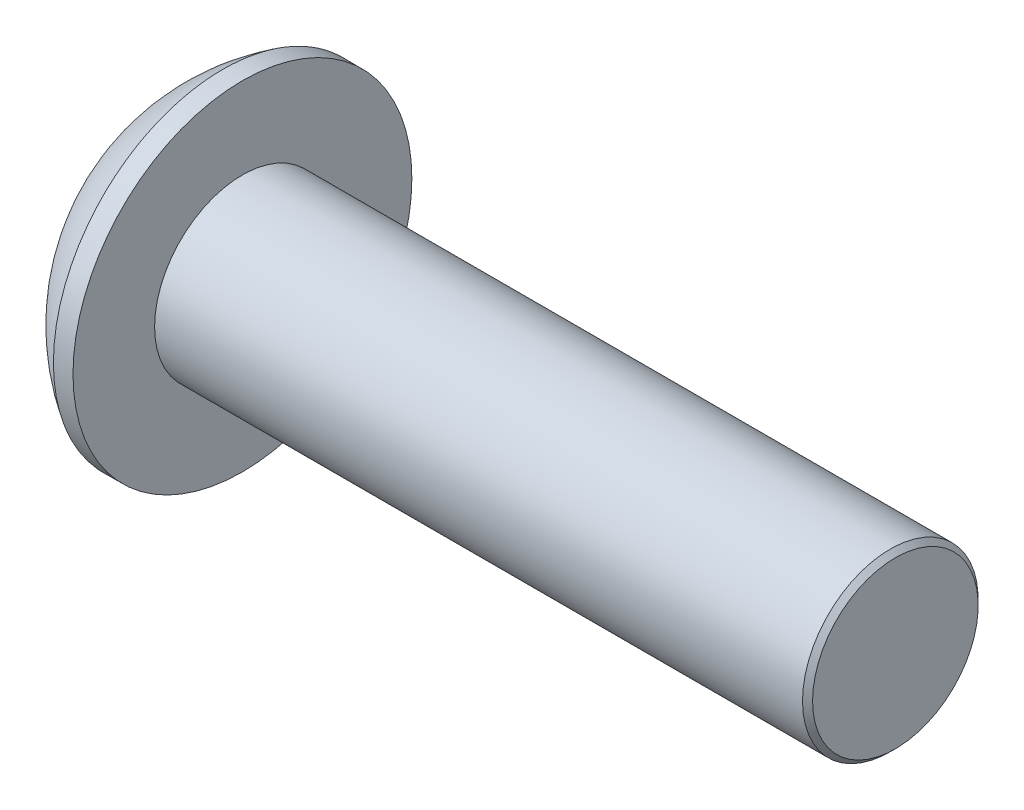
ISO-10303-21;
HEADER;
FILE_DESCRIPTION(('STEP AP214'),'2;1');
FILE_NAME('part.step','',(''),(''),'','','');
FILE_SCHEMA(('AUTOMOTIVE_DESIGN { 1 0 10303 214 1 1 1 1 }'));
ENDSEC;
DATA;
#1=APPLICATION_CONTEXT('core data for automotive mechanical design processes');
#2=APPLICATION_PROTOCOL_DEFINITION('international standard','automotive_design',2000,#1);
#3=PRODUCT_CONTEXT('',#1,'mechanical');
#4=PRODUCT('Part','Part','',(#3));
#5=PRODUCT_RELATED_PRODUCT_CATEGORY('part','',(#4));
#6=PRODUCT_DEFINITION_FORMATION('','',#4);
#7=PRODUCT_DEFINITION_CONTEXT('part definition',#1,'design');
#8=PRODUCT_DEFINITION('design','',#6,#7);
#9=PRODUCT_DEFINITION_SHAPE('','',#8);
#10=(LENGTH_UNIT() NAMED_UNIT(*) SI_UNIT(.MILLI.,.METRE.));
#11=(NAMED_UNIT(*) PLANE_ANGLE_UNIT() SI_UNIT($,.RADIAN.));
#12=(NAMED_UNIT(*) SI_UNIT($,.STERADIAN.) SOLID_ANGLE_UNIT());
#13=UNCERTAINTY_MEASURE_WITH_UNIT(LENGTH_MEASURE(1.E-05),#10,'distance_accuracy_value','');
#14=(GEOMETRIC_REPRESENTATION_CONTEXT(3) GLOBAL_UNCERTAINTY_ASSIGNED_CONTEXT((#13)) GLOBAL_UNIT_ASSIGNED_CONTEXT((#10,
#11,#12)) REPRESENTATION_CONTEXT('',''));
#15=CARTESIAN_POINT('',(0.,0.,0.));
#16=DIRECTION('',(0.,0.,1.));
#17=DIRECTION('',(1.,0.,0.));
#18=AXIS2_PLACEMENT_3D('',#15,#16,#17);
#19=CARTESIAN_POINT('',(1.32080000000034,0.,0.));
#20=DIRECTION('',(-1.,0.,0.));
#21=DIRECTION('',(0.,0.,1.));
#22=AXIS2_PLACEMENT_3D('',#19,#20,#21);
#23=CONICAL_SURFACE('',#22,1.1937999999998,1.04719755119608);
#24=CARTESIAN_POINT('',(2.01004075135902,0.,4.44089209850063E-13));
#25=VERTEX_POINT('',#24);
#26=VERTEX_LOOP('',#25);
#27=FACE_BOUND('',#26,.T.);
#28=CARTESIAN_POINT('',(1.32080000000009,0.,0.));
#29=DIRECTION('',(-1.,0.,0.));
#30=DIRECTION('',(0.,0.,1.));
#31=AXIS2_PLACEMENT_3D('',#28,#29,#30);
#32=CIRCLE('',#31,1.19380000000024);
#33=CARTESIAN_POINT('',(1.32080000000004,-1.03386112703797,0.59690000000006));
#34=VERTEX_POINT('',#33);
#35=CARTESIAN_POINT('',(1.32080000000004,0.,1.19380000000012));
#36=VERTEX_POINT('',#35);
#37=EDGE_CURVE('E19',#34,#36,#32,.T.);
#38=ORIENTED_EDGE('',*,*,#37,.T.);
#39=CARTESIAN_POINT('',(1.32080000000009,0.,0.));
#40=DIRECTION('',(-1.,0.,0.));
#41=DIRECTION('',(0.,0.,1.));
#42=AXIS2_PLACEMENT_3D('',#39,#40,#41);
#43=CIRCLE('',#42,1.19380000000024);
#44=CARTESIAN_POINT('',(1.32080000000004,1.03386112703797,0.596900000000061));
#45=VERTEX_POINT('',#44);
#46=EDGE_CURVE('E147',#36,#45,#43,.T.);
#47=ORIENTED_EDGE('',*,*,#46,.T.);
#48=CARTESIAN_POINT('',(1.32080000000009,0.,0.));
#49=DIRECTION('',(-1.,0.,0.));
#50=DIRECTION('',(0.,0.,1.));
#51=AXIS2_PLACEMENT_3D('',#48,#49,#50);
#52=CIRCLE('',#51,1.19380000000024);
#53=CARTESIAN_POINT('',(1.32080000000004,1.03386112703797,-0.596900000000061));
#54=VERTEX_POINT('',#53);
#55=EDGE_CURVE('E317',#45,#54,#52,.T.);
#56=ORIENTED_EDGE('',*,*,#55,.T.);
#57=CARTESIAN_POINT('',(1.32080000000009,0.,0.));
#58=DIRECTION('',(-1.,0.,0.));
#59=DIRECTION('',(0.,0.,1.));
#60=AXIS2_PLACEMENT_3D('',#57,#58,#59);
#61=CIRCLE('',#60,1.19380000000024);
#62=CARTESIAN_POINT('',(1.32080000000004,1.49457637585666E-12,-1.19380000000012));
#63=VERTEX_POINT('',#62);
#64=EDGE_CURVE('E318',#54,#63,#61,.T.);
#65=ORIENTED_EDGE('',*,*,#64,.T.);
#66=CARTESIAN_POINT('',(1.32080000000009,0.,0.));
#67=DIRECTION('',(-1.,0.,0.));
#68=DIRECTION('',(0.,0.,1.));
#69=AXIS2_PLACEMENT_3D('',#66,#67,#68);
#70=CIRCLE('',#69,1.19380000000024);
#71=CARTESIAN_POINT('',(1.32080000000004,-1.03386112703797,-0.59690000000006));
#72=VERTEX_POINT('',#71);
#73=EDGE_CURVE('E92',#63,#72,#70,.T.);
#74=ORIENTED_EDGE('',*,*,#73,.T.);
#75=CARTESIAN_POINT('',(1.32080000000009,0.,0.));
#76=DIRECTION('',(-1.,0.,0.));
#77=DIRECTION('',(0.,0.,1.));
#78=AXIS2_PLACEMENT_3D('',#75,#76,#77);
#79=CIRCLE('',#78,1.19380000000024);
#80=EDGE_CURVE('E88',#72,#34,#79,.T.);
#81=ORIENTED_EDGE('',*,*,#80,.T.);
#82=EDGE_LOOP('',(#38,#47,#56,#65,#74,#81));
#83=FACE_BOUND('',#82,.T.);
#84=ADVANCED_FACE('F16',(#27,#83),#23,.F.);
#85=CARTESIAN_POINT('',(1.3208,-2.06772225407572,-1.1938));
#86=DIRECTION('',(1.,0.,0.));
#87=DIRECTION('',(0.,0.,-1.));
#88=AXIS2_PLACEMENT_3D('',#85,#86,#87);
#89=PLANE('',#88);
#90=DIRECTION('',(0.,0.5,0.866025403784439));
#91=VECTOR('',#90,1.);
#92=CARTESIAN_POINT('',(1.3208,-1.37848150271715,0.));
#93=LINE('',#92,#91);
#94=CARTESIAN_POINT('',(1.3208,-0.689240751358574,1.1938));
#95=VERTEX_POINT('',#94);
#96=EDGE_CURVE('E100',#95,#34,#93,.F.);
#97=ORIENTED_EDGE('',*,*,#96,.F.);
#98=DIRECTION('',(0.,1.,0.));
#99=VECTOR('',#98,1.);
#100=CARTESIAN_POINT('',(1.3208,-0.689240751358574,1.1938));
#101=LINE('',#100,#99);
#102=EDGE_CURVE('E102',#36,#95,#101,.F.);
#103=ORIENTED_EDGE('',*,*,#102,.F.);
#104=ORIENTED_EDGE('',*,*,#37,.F.);
#105=EDGE_LOOP('',(#97,#103,#104));
#106=FACE_BOUND('',#105,.T.);
#107=ADVANCED_FACE('F98',(#106),#89,.F.);
#108=CARTESIAN_POINT('',(1.3208,-2.06772225407572,-1.1938));
#109=DIRECTION('',(1.,0.,0.));
#110=DIRECTION('',(0.,0.,-1.));
#111=AXIS2_PLACEMENT_3D('',#108,#109,#110);
#112=PLANE('',#111);
#113=DIRECTION('',(0.,-0.5,0.866025403784439));
#114=VECTOR('',#113,1.);
#115=CARTESIAN_POINT('',(1.3208,-0.689240751358574,-1.1938));
#116=LINE('',#115,#114);
#117=CARTESIAN_POINT('',(1.3208,-1.37848150271715,0.));
#118=VERTEX_POINT('',#117);
#119=EDGE_CURVE('E108',#118,#72,#116,.F.);
#120=ORIENTED_EDGE('',*,*,#119,.F.);
#121=DIRECTION('',(0.,0.5,0.866025403784439));
#122=VECTOR('',#121,1.);
#123=CARTESIAN_POINT('',(1.3208,-1.37848150271715,0.));
#124=LINE('',#123,#122);
#125=EDGE_CURVE('E105',#34,#118,#124,.F.);
#126=ORIENTED_EDGE('',*,*,#125,.F.);
#127=ORIENTED_EDGE('',*,*,#80,.F.);
#128=EDGE_LOOP('',(#120,#126,#127));
#129=FACE_BOUND('',#128,.T.);
#130=ADVANCED_FACE('F106',(#129),#112,.F.);
#131=CARTESIAN_POINT('',(1.3208,-2.06772225407572,-1.1938));
#132=DIRECTION('',(1.,0.,0.));
#133=DIRECTION('',(0.,0.,-1.));
#134=AXIS2_PLACEMENT_3D('',#131,#132,#133);
#135=PLANE('',#134);
#136=DIRECTION('',(0.,1.,0.));
#137=VECTOR('',#136,1.);
#138=CARTESIAN_POINT('',(1.3208,0.689240751358577,-1.1938));
#139=LINE('',#138,#137);
#140=CARTESIAN_POINT('',(1.3208,-0.689240751358574,-1.1938));
#141=VERTEX_POINT('',#140);
#142=EDGE_CURVE('E287',#141,#63,#139,.T.);
#143=ORIENTED_EDGE('',*,*,#142,.F.);
#144=DIRECTION('',(0.,-0.5,0.866025403784439));
#145=VECTOR('',#144,1.);
#146=CARTESIAN_POINT('',(1.3208,-0.689240751358574,-1.1938));
#147=LINE('',#146,#145);
#148=EDGE_CURVE('E299',#72,#141,#147,.F.);
#149=ORIENTED_EDGE('',*,*,#148,.F.);
#150=ORIENTED_EDGE('',*,*,#73,.F.);
#151=EDGE_LOOP('',(#143,#149,#150));
#152=FACE_BOUND('',#151,.T.);
#153=ADVANCED_FACE('F190',(#152),#135,.F.);
#154=CARTESIAN_POINT('',(1.3208,-2.06772225407572,-1.1938));
#155=DIRECTION('',(1.,0.,0.));
#156=DIRECTION('',(0.,0.,-1.));
#157=AXIS2_PLACEMENT_3D('',#154,#155,#156);
#158=PLANE('',#157);
#159=DIRECTION('',(0.,-0.5,-0.866025403784439));
#160=VECTOR('',#159,1.);
#161=CARTESIAN_POINT('',(1.3208,1.37848150271715,0.));
#162=LINE('',#161,#160);
#163=CARTESIAN_POINT('',(1.3208,0.689240751358577,-1.1938));
#164=VERTEX_POINT('',#163);
#165=EDGE_CURVE('E273',#164,#54,#162,.F.);
#166=ORIENTED_EDGE('',*,*,#165,.F.);
#167=DIRECTION('',(0.,1.,0.));
#168=VECTOR('',#167,1.);
#169=CARTESIAN_POINT('',(1.3208,0.689240751358577,-1.1938));
#170=LINE('',#169,#168);
#171=EDGE_CURVE('E284',#63,#164,#170,.T.);
#172=ORIENTED_EDGE('',*,*,#171,.F.);
#173=ORIENTED_EDGE('',*,*,#64,.F.);
#174=EDGE_LOOP('',(#166,#172,#173));
#175=FACE_BOUND('',#174,.T.);
#176=ADVANCED_FACE('F186',(#175),#158,.F.);
#177=CARTESIAN_POINT('',(1.3208,-2.06772225407572,-1.1938));
#178=DIRECTION('',(1.,0.,0.));
#179=DIRECTION('',(0.,0.,-1.));
#180=AXIS2_PLACEMENT_3D('',#177,#178,#179);
#181=PLANE('',#180);
#182=DIRECTION('',(0.,0.5,-0.866025403784439));
#183=VECTOR('',#182,1.);
#184=CARTESIAN_POINT('',(1.3208,0.689240751358576,1.1938));
#185=LINE('',#184,#183);
#186=CARTESIAN_POINT('',(1.3208,1.37848150271715,0.));
#187=VERTEX_POINT('',#186);
#188=EDGE_CURVE('E252',#187,#45,#185,.F.);
#189=ORIENTED_EDGE('',*,*,#188,.F.);
#190=DIRECTION('',(0.,-0.5,-0.866025403784439));
#191=VECTOR('',#190,1.);
#192=CARTESIAN_POINT('',(1.3208,1.37848150271715,0.));
#193=LINE('',#192,#191);
#194=EDGE_CURVE('E271',#54,#187,#193,.F.);
#195=ORIENTED_EDGE('',*,*,#194,.F.);
#196=ORIENTED_EDGE('',*,*,#55,.F.);
#197=EDGE_LOOP('',(#189,#195,#196));
#198=FACE_BOUND('',#197,.T.);
#199=ADVANCED_FACE('F182',(#198),#181,.F.);
#200=CARTESIAN_POINT('',(1.3208,-2.06772225407572,-1.1938));
#201=DIRECTION('',(1.,0.,0.));
#202=DIRECTION('',(0.,0.,-1.));
#203=AXIS2_PLACEMENT_3D('',#200,#201,#202);
#204=PLANE('',#203);
#205=DIRECTION('',(0.,1.,0.));
#206=VECTOR('',#205,1.);
#207=CARTESIAN_POINT('',(1.3208,-0.689240751358574,1.1938));
#208=LINE('',#207,#206);
#209=CARTESIAN_POINT('',(1.3208,0.689240751358576,1.1938));
#210=VERTEX_POINT('',#209);
#211=EDGE_CURVE('E117',#210,#36,#208,.F.);
#212=ORIENTED_EDGE('',*,*,#211,.F.);
#213=DIRECTION('',(0.,0.5,-0.866025403784439));
#214=VECTOR('',#213,1.);
#215=CARTESIAN_POINT('',(1.3208,0.689240751358576,1.1938));
#216=LINE('',#215,#214);
#217=EDGE_CURVE('E255',#45,#210,#216,.F.);
#218=ORIENTED_EDGE('',*,*,#217,.F.);
#219=ORIENTED_EDGE('',*,*,#46,.F.);
#220=EDGE_LOOP('',(#212,#218,#219));
#221=FACE_BOUND('',#220,.T.);
#222=ADVANCED_FACE('F178',(#221),#204,.F.);
#223=CARTESIAN_POINT('',(1.3208,-0.689240751358574,1.1938));
#224=DIRECTION('',(0.,0.,-1.));
#225=DIRECTION('',(0.,1.,0.));
#226=AXIS2_PLACEMENT_3D('',#223,#224,#225);
#227=PLANE('',#226);
#228=DIRECTION('',(0.,1.,0.));
#229=VECTOR('',#228,1.);
#230=CARTESIAN_POINT('',(0.,0.,1.1938));
#231=LINE('',#230,#229);
#232=CARTESIAN_POINT('',(0.,0.689240751358577,1.1938));
#233=VERTEX_POINT('',#232);
#234=CARTESIAN_POINT('',(0.,-0.689240751358574,1.1938));
#235=VERTEX_POINT('',#234);
#236=EDGE_CURVE('E249',#233,#235,#231,.F.);
#237=ORIENTED_EDGE('',*,*,#236,.F.);
#238=DIRECTION('',(1.,0.,0.));
#239=VECTOR('',#238,1.);
#240=CARTESIAN_POINT('',(1.3208,0.689240751358576,1.1938));
#241=LINE('',#240,#239);
#242=EDGE_CURVE('E261',#210,#233,#241,.F.);
#243=ORIENTED_EDGE('',*,*,#242,.F.);
#244=ORIENTED_EDGE('',*,*,#211,.T.);
#245=ORIENTED_EDGE('',*,*,#102,.T.);
#246=DIRECTION('',(1.,0.,0.));
#247=VECTOR('',#246,1.);
#248=CARTESIAN_POINT('',(1.3208,-0.689240751358574,1.1938));
#249=LINE('',#248,#247);
#250=EDGE_CURVE('E111',#235,#95,#249,.T.);
#251=ORIENTED_EDGE('',*,*,#250,.F.);
#252=EDGE_LOOP('',(#237,#243,#244,#245,#251));
#253=FACE_BOUND('',#252,.T.);
#254=ADVANCED_FACE('F175',(#253),#227,.T.);
#255=CARTESIAN_POINT('',(1.3208,-1.37848150271715,0.));
#256=DIRECTION('',(0.,0.866025403784439,-0.5));
#257=DIRECTION('',(0.,0.5,0.866025403784439));
#258=AXIS2_PLACEMENT_3D('',#255,#256,#257);
#259=PLANE('',#258);
#260=DIRECTION('',(0.,-0.5,-0.866025403784439));
#261=VECTOR('',#260,1.);
#262=CARTESIAN_POINT('',(0.,-0.689240751358574,1.1938));
#263=LINE('',#262,#261);
#264=CARTESIAN_POINT('',(0.,-1.37848150271715,0.));
#265=VERTEX_POINT('',#264);
#266=EDGE_CURVE('E246',#235,#265,#263,.T.);
#267=ORIENTED_EDGE('',*,*,#266,.F.);
#268=ORIENTED_EDGE('',*,*,#250,.T.);
#269=ORIENTED_EDGE('',*,*,#96,.T.);
#270=ORIENTED_EDGE('',*,*,#125,.T.);
#271=DIRECTION('',(1.,0.,0.));
#272=VECTOR('',#271,1.);
#273=CARTESIAN_POINT('',(1.3208,-1.37848150271715,0.));
#274=LINE('',#273,#272);
#275=EDGE_CURVE('E296',#265,#118,#274,.T.);
#276=ORIENTED_EDGE('',*,*,#275,.F.);
#277=EDGE_LOOP('',(#267,#268,#269,#270,#276));
#278=FACE_BOUND('',#277,.T.);
#279=ADVANCED_FACE('F115',(#278),#259,.T.);
#280=CARTESIAN_POINT('',(1.3208,-0.689240751358574,-1.1938));
#281=DIRECTION('',(0.,0.866025403784439,0.5));
#282=DIRECTION('',(0.,-0.5,0.866025403784439));
#283=AXIS2_PLACEMENT_3D('',#280,#281,#282);
#284=PLANE('',#283);
#285=DIRECTION('',(0.,0.5,-0.866025403784439));
#286=VECTOR('',#285,1.);
#287=CARTESIAN_POINT('',(0.,-1.37848150271715,0.));
#288=LINE('',#287,#286);
#289=CARTESIAN_POINT('',(0.,-0.689240751358574,-1.1938));
#290=VERTEX_POINT('',#289);
#291=EDGE_CURVE('E243',#265,#290,#288,.T.);
#292=ORIENTED_EDGE('',*,*,#291,.F.);
#293=ORIENTED_EDGE('',*,*,#275,.T.);
#294=ORIENTED_EDGE('',*,*,#119,.T.);
#295=ORIENTED_EDGE('',*,*,#148,.T.);
#296=DIRECTION('',(1.,0.,0.));
#297=VECTOR('',#296,1.);
#298=CARTESIAN_POINT('',(1.3208,-0.689240751358574,-1.1938));
#299=LINE('',#298,#297);
#300=EDGE_CURVE('E281',#290,#141,#299,.T.);
#301=ORIENTED_EDGE('',*,*,#300,.F.);
#302=EDGE_LOOP('',(#292,#293,#294,#295,#301));
#303=FACE_BOUND('',#302,.T.);
#304=ADVANCED_FACE('F168',(#303),#284,.T.);
#305=CARTESIAN_POINT('',(1.3208,0.689240751358577,-1.1938));
#306=DIRECTION('',(0.,0.,1.));
#307=DIRECTION('',(1.,0.,0.));
#308=AXIS2_PLACEMENT_3D('',#305,#306,#307);
#309=PLANE('',#308);
#310=DIRECTION('',(0.,1.,0.));
#311=VECTOR('',#310,1.);
#312=CARTESIAN_POINT('',(0.,0.,-1.1938));
#313=LINE('',#312,#311);
#314=CARTESIAN_POINT('',(0.,0.689240751358577,-1.1938));
#315=VERTEX_POINT('',#314);
#316=EDGE_CURVE('E240',#290,#315,#313,.T.);
#317=ORIENTED_EDGE('',*,*,#316,.F.);
#318=ORIENTED_EDGE('',*,*,#300,.T.);
#319=ORIENTED_EDGE('',*,*,#142,.T.);
#320=ORIENTED_EDGE('',*,*,#171,.T.);
#321=DIRECTION('',(1.,0.,0.));
#322=VECTOR('',#321,1.);
#323=CARTESIAN_POINT('',(1.3208,0.689240751358577,-1.1938));
#324=LINE('',#323,#322);
#325=EDGE_CURVE('E256',#315,#164,#324,.T.);
#326=ORIENTED_EDGE('',*,*,#325,.F.);
#327=EDGE_LOOP('',(#317,#318,#319,#320,#326));
#328=FACE_BOUND('',#327,.T.);
#329=ADVANCED_FACE('F165',(#328),#309,.T.);
#330=CARTESIAN_POINT('',(1.3208,1.37848150271715,0.));
#331=DIRECTION('',(0.,-0.866025403784439,0.5));
#332=DIRECTION('',(0.,-0.5,-0.866025403784439));
#333=AXIS2_PLACEMENT_3D('',#330,#331,#332);
#334=PLANE('',#333);
#335=DIRECTION('',(0.,0.5,0.866025403784439));
#336=VECTOR('',#335,1.);
#337=CARTESIAN_POINT('',(0.,0.689240751358577,-1.1938));
#338=LINE('',#337,#336);
#339=CARTESIAN_POINT('',(0.,1.37848150271715,0.));
#340=VERTEX_POINT('',#339);
#341=EDGE_CURVE('E237',#315,#340,#338,.T.);
#342=ORIENTED_EDGE('',*,*,#341,.F.);
#343=ORIENTED_EDGE('',*,*,#325,.T.);
#344=ORIENTED_EDGE('',*,*,#165,.T.);
#345=ORIENTED_EDGE('',*,*,#194,.T.);
#346=DIRECTION('',(1.,0.,0.));
#347=VECTOR('',#346,1.);
#348=CARTESIAN_POINT('',(1.3208,1.37848150271715,0.));
#349=LINE('',#348,#347);
#350=EDGE_CURVE('E34',#340,#187,#349,.T.);
#351=ORIENTED_EDGE('',*,*,#350,.F.);
#352=EDGE_LOOP('',(#342,#343,#344,#345,#351));
#353=FACE_BOUND('',#352,.T.);
#354=ADVANCED_FACE('F161',(#353),#334,.T.);
#355=CARTESIAN_POINT('',(1.3208,0.689240751358576,1.1938));
#356=DIRECTION('',(0.,-0.866025403784439,-0.5));
#357=DIRECTION('',(0.,0.5,-0.866025403784439));
#358=AXIS2_PLACEMENT_3D('',#355,#356,#357);
#359=PLANE('',#358);
#360=DIRECTION('',(0.,-0.5,0.866025403784439));
#361=VECTOR('',#360,1.);
#362=CARTESIAN_POINT('',(0.,1.37848150271715,0.));
#363=LINE('',#362,#361);
#364=EDGE_CURVE('E146',#340,#233,#363,.T.);
#365=ORIENTED_EDGE('',*,*,#364,.F.);
#366=ORIENTED_EDGE('',*,*,#350,.T.);
#367=ORIENTED_EDGE('',*,*,#188,.T.);
#368=ORIENTED_EDGE('',*,*,#217,.T.);
#369=ORIENTED_EDGE('',*,*,#242,.T.);
#370=EDGE_LOOP('',(#365,#366,#367,#368,#369));
#371=FACE_BOUND('',#370,.T.);
#372=ADVANCED_FACE('F157',(#371),#359,.T.);
#373=CARTESIAN_POINT('',(0.,0.,0.));
#374=DIRECTION('',(-1.,0.,0.));
#375=DIRECTION('',(0.,0.,1.));
#376=AXIS2_PLACEMENT_3D('',#373,#374,#375);
#377=PLANE('',#376);
#378=ORIENTED_EDGE('',*,*,#341,.T.);
#379=ORIENTED_EDGE('',*,*,#364,.T.);
#380=ORIENTED_EDGE('',*,*,#236,.T.);
#381=ORIENTED_EDGE('',*,*,#266,.T.);
#382=ORIENTED_EDGE('',*,*,#291,.T.);
#383=ORIENTED_EDGE('',*,*,#316,.T.);
#384=EDGE_LOOP('',(#378,#379,#380,#381,#382,#383));
#385=FACE_BOUND('',#384,.T.);
#386=CARTESIAN_POINT('',(0.,1.647825,0.));
#387=CARTESIAN_POINT('',(1.63319194702151E-13,1.64781976319874,0.092490203977753));
#388=CARTESIAN_POINT('',(1.32890083579297E-13,1.63999511633709,0.18514501432637));
#389=CARTESIAN_POINT('',(0.,1.6167119250047,0.322075808080013));
#390=CARTESIAN_POINT('',(-1.58500729597375E-13,1.60700618770234,0.36743553339636));
#391=CARTESIAN_POINT('',(1.59063479291743E-13,1.58380101865853,0.45722093569514));
#392=CARTESIAN_POINT('',(5.6924253476393E-13,1.5702985083103,0.501645823115263));
#393=CARTESIAN_POINT('',(9.37393023603841E-13,1.52428156574313,0.632817459278967));
#394=CARTESIAN_POINT('',(0.,1.48621992666366,0.717681965518643));
#395=CARTESIAN_POINT('',(0.,1.39637079695658,0.879809706624016));
#396=CARTESIAN_POINT('',(7.82184274151218E-13,1.34458278455109,0.957072652379995));
#397=CARTESIAN_POINT('',(4.86982737501784E-13,1.25777784714521,1.06558770210237));
#398=CARTESIAN_POINT('',(1.33453761487452E-13,1.22729946114794,1.10054993332365));
#399=CARTESIAN_POINT('',(-1.3289162015903E-13,1.16354004969106,1.16775237388221));
#400=CARTESIAN_POINT('',(0.,1.13026175473033,1.19999517515816));
#401=CARTESIAN_POINT('',(0.,1.02649304340867,1.29236218866442));
#402=CARTESIAN_POINT('',(0.,0.952049986714077,1.34814848277712));
#403=CARTESIAN_POINT('',(0.,0.794895196754067,1.44639825105765));
#404=CARTESIAN_POINT('',(0.,0.712183775431296,1.48886222758992));
#405=CARTESIAN_POINT('',(0.,0.540796624265731,1.55930919813143));
#406=CARTESIAN_POINT('',(0.,0.452120958135287,1.58729234680268));
#407=CARTESIAN_POINT('',(0.,0.271332331080319,1.62797191307413));
#408=CARTESIAN_POINT('',(0.,0.179219351801791,1.64066824903626));
#409=CARTESIAN_POINT('',(0.,-0.0058307702784061,1.65041748705408));
#410=CARTESIAN_POINT('',(0.,-0.0987679130800752,1.64747038910978));
#411=CARTESIAN_POINT('',(0.,-0.282830196388822,1.62601274134435));
#412=CARTESIAN_POINT('',(0.,-0.373955346570016,1.60750227463794));
#413=CARTESIAN_POINT('',(0.,-0.551796068178801,1.55545413364523));
#414=CARTESIAN_POINT('',(0.,-0.638511592498163,1.52191629885843));
#415=CARTESIAN_POINT('',(0.,-0.805120175533149,1.44072378052346));
#416=CARTESIAN_POINT('',(0.,-0.885012976819951,1.39306856461393));
#417=CARTESIAN_POINT('',(0.,-0.997912879588355,1.31211658756413));
#418=CARTESIAN_POINT('',(0.,-1.0343949246834,1.28354906167734));
#419=CARTESIAN_POINT('',(0.,-1.10486279842068,1.22341829303709));
#420=CARTESIAN_POINT('',(0.,-1.13884618403291,1.19185218578117));
#421=CARTESIAN_POINT('',(0.,-1.23657300939908,1.09305906467359));
#422=CARTESIAN_POINT('',(0.,-1.29619288399356,1.02166556658612));
#423=CARTESIAN_POINT('',(0.,-1.40258050817755,0.869876423478031));
#424=CARTESIAN_POINT('',(0.,-1.44934874627766,0.789481120793477));
#425=CARTESIAN_POINT('',(0.,-1.50889406070375,0.66387095931334));
#426=CARTESIAN_POINT('',(0.,-1.52698985473586,0.621110806760426));
#427=CARTESIAN_POINT('',(0.,-1.55950093966664,0.53426077686433));
#428=CARTESIAN_POINT('',(-1.05235362596779E-13,-1.57391920916438,0.490172008203167));
#429=CARTESIAN_POINT('',(2.10568324685354E-13,-1.61146177909579,0.356445777718595));
#430=CARTESIAN_POINT('',(1.14396658334039E-12,-1.62897899568074,0.265126085962904));
#431=CARTESIAN_POINT('',(4.347347107204E-13,-1.64174347214908,0.144386595969386));
#432=CARTESIAN_POINT('',(1.21682740895759E-13,-1.64402207668915,0.115560405797873));
#433=CARTESIAN_POINT('',(-1.21249060026839E-13,-1.6470636594012,0.0578281757252688));
#434=CARTESIAN_POINT('',(0.,-1.64782663757318,0.0289221358241775));
#435=CARTESIAN_POINT('',(1.63505268006993E-13,-1.64781976319874,-0.0924902039777536));
#436=CARTESIAN_POINT('',(1.32794566155401E-13,-1.63999511633709,-0.18514501432637));
#437=CARTESIAN_POINT('',(0.,-1.6167119250047,-0.322075808080014));
#438=CARTESIAN_POINT('',(-1.58310187784522E-13,-1.60700618770234,-0.367435533396361));
#439=CARTESIAN_POINT('',(1.58872782530651E-13,-1.58380101865853,-0.45722093569514));
#440=CARTESIAN_POINT('',(5.68527399730162E-13,-1.5702985083103,-0.501645823115263));
#441=CARTESIAN_POINT('',(9.36221934104128E-13,-1.52428156574313,-0.632817459278966));
#442=CARTESIAN_POINT('',(0.,-1.48621992666366,-0.717681965518643));
#443=CARTESIAN_POINT('',(0.,-1.39637079695658,-0.879809706624015));
#444=CARTESIAN_POINT('',(7.809853327574E-13,-1.34458278455109,-0.957072652379992));
#445=CARTESIAN_POINT('',(4.86281382838322E-13,-1.25777784714521,-1.06558770210237));
#446=CARTESIAN_POINT('',(1.33300307899813E-13,-1.22729946114794,-1.10054993332365));
#447=CARTESIAN_POINT('',(-1.32738314523763E-13,-1.16354004969107,-1.16775237388221));
#448=CARTESIAN_POINT('',(0.,-1.13026175473033,-1.19999517515816));
#449=CARTESIAN_POINT('',(0.,-1.02649304340867,-1.29236218866442));
#450=CARTESIAN_POINT('',(0.,-0.952049986714081,-1.34814848277713));
#451=CARTESIAN_POINT('',(0.,-0.794895196754072,-1.44639825105765));
#452=CARTESIAN_POINT('',(0.,-0.7121837754313,-1.48886222758991));
#453=CARTESIAN_POINT('',(0.,-0.540796624265734,-1.55930919813143));
#454=CARTESIAN_POINT('',(0.,-0.452120958135291,-1.58729234680268));
#455=CARTESIAN_POINT('',(0.,-0.271332331080322,-1.62797191307413));
#456=CARTESIAN_POINT('',(0.,-0.179219351801793,-1.64066824903626));
#457=CARTESIAN_POINT('',(0.,0.00583077027840386,-1.65041748705408));
#458=CARTESIAN_POINT('',(0.,0.0987679130800731,-1.64747038910978));
#459=CARTESIAN_POINT('',(0.,0.28283019638882,-1.62601274134436));
#460=CARTESIAN_POINT('',(0.,0.373955346570014,-1.60750227463794));
#461=CARTESIAN_POINT('',(0.,0.551796068178799,-1.55545413364523));
#462=CARTESIAN_POINT('',(0.,0.638511592498161,-1.52191629885844));
#463=CARTESIAN_POINT('',(0.,0.805120175533147,-1.44072378052347));
#464=CARTESIAN_POINT('',(0.,0.885012976819949,-1.39306856461393));
#465=CARTESIAN_POINT('',(0.,0.997912879588353,-1.31211658756413));
#466=CARTESIAN_POINT('',(0.,1.03439492468339,-1.28354906167734));
#467=CARTESIAN_POINT('',(0.,1.10486279842068,-1.22341829303709));
#468=CARTESIAN_POINT('',(0.,1.1388461840329,-1.19185218578117));
#469=CARTESIAN_POINT('',(0.,1.23657300939908,-1.09305906467358));
#470=CARTESIAN_POINT('',(0.,1.29619288399356,-1.02166556658612));
#471=CARTESIAN_POINT('',(0.,1.40258050817755,-0.869876423478032));
#472=CARTESIAN_POINT('',(0.,1.44934874627765,-0.789481120793476));
#473=CARTESIAN_POINT('',(0.,1.50889406070375,-0.66387095931334));
#474=CARTESIAN_POINT('',(0.,1.52698985473586,-0.621110806760427));
#475=CARTESIAN_POINT('',(0.,1.55950093966664,-0.534260776864331));
#476=CARTESIAN_POINT('',(-1.05163336027755E-13,1.57391920916437,-0.490172008203168));
#477=CARTESIAN_POINT('',(2.10424649207135E-13,1.61146177909579,-0.356445777718595));
#478=CARTESIAN_POINT('',(1.1439193518672E-12,1.62897899568074,-0.265126085962905));
#479=CARTESIAN_POINT('',(4.34749480231378E-13,1.64174347214908,-0.144386595969387));
#480=CARTESIAN_POINT('',(1.21707467703441E-13,1.64402207668915,-0.115560405797874));
#481=CARTESIAN_POINT('',(-1.21273786834522E-13,1.6470636594012,-0.0578281757252697));
#482=CARTESIAN_POINT('',(0.,1.64782663757318,-0.0289221358241784));
#483=CARTESIAN_POINT('',(0.,1.647825,0.));
#484=B_SPLINE_CURVE_WITH_KNOTS('',3,(#386,#387,#388,#389,#390,#391,#392,#393,#394,#395,#396,
#397,#398,#399,#400,#401,#402,#403,#404,#405,#406,#407,#408,#409,#410,#411,#412,#413,#414,#415,
#416,#417,#418,#419,#420,#421,#422,#423,#424,#425,#426,#427,#428,#429,#430,#431,#432,#433,#434,
#435,#436,#437,#438,#439,#440,#441,#442,#443,#444,#445,#446,#447,#448,#449,#450,#451,#452,#453,
#454,#455,#456,#457,#458,#459,#460,#461,#462,#463,#464,#465,#466,#467,#468,#469,#470,#471,#472,
#473,#474,#475,#476,#477,#478,#479,#480,#481,#482,#483),.UNSPECIFIED.,.T.,.F.,(4,2,2,2,2,2,2,2,
2,2,2,2,2,2,2,2,2,2,2,2,2,2,2,2,2,2,2,2,2,2,2,2,2,2,2,2,2,2,2,2,2,2,2,2,2,2,2,2,4),(0.,
0.277336029422426,0.416368541537111,0.5555141146256,0.833141970294986,1.11078038089036,
1.24978149120748,1.38864858351854,1.66629367015056,1.94392828594775,2.22155993641642,
2.49919306954937,2.77682620268234,3.05445785315101,3.3320924689482,3.6097375555799,
3.74860464789074,3.88760575820767,4.16524416880332,4.44287202447287,4.5820175975616,
4.72105010967662,4.99838613909882,5.08511046196677,5.17183478483476,5.44917081425719,
5.58820332637187,5.72734889946036,6.00497675512975,6.28261516572512,6.42161627604224,
6.5604833683533,6.83812845498532,7.11576307078251,7.39339472125118,7.67102785438413,
7.9486609875171,8.22629263798578,8.50392725378296,8.78157234041466,8.9204394327255,
9.05944054304243,9.33707895363808,9.61470680930763,9.75385238239637,9.89288489451138,
10.1702209239336,10.2569452468015,10.3436695696695),.UNSPECIFIED.);
#485=CARTESIAN_POINT('',(0.,1.647825,0.));
#486=VERTEX_POINT('',#485);
#487=EDGE_CURVE('E139',#486,#486,#484,.T.);
#488=ORIENTED_EDGE('',*,*,#487,.F.);
#489=EDGE_LOOP('',(#488));
#490=FACE_BOUND('',#489,.T.);
#491=ADVANCED_FACE('F153',(#385,#490),#377,.T.);
#492=CARTESIAN_POINT('',(3.50132362607759,0.,0.));
#493=DIRECTION('',(0.,1.,0.));
#494=DIRECTION('',(1.,0.,0.));
#495=AXIS2_PLACEMENT_3D('',#492,#493,#494);
#496=SPHERICAL_SURFACE('',#495,3.86970210289553);
#497=CARTESIAN_POINT('',(1.4732,0.,0.));
#498=DIRECTION('',(-1.,0.,0.));
#499=DIRECTION('',(0.,0.,1.));
#500=AXIS2_PLACEMENT_3D('',#497,#498,#499);
#501=CIRCLE('',#500,3.29565);
#502=CARTESIAN_POINT('',(1.4732,0.,3.29565));
#503=VERTEX_POINT('',#502);
#504=EDGE_CURVE('E136',#503,#503,#501,.F.);
#505=ORIENTED_EDGE('',*,*,#504,.F.);
#506=EDGE_LOOP('',(#505));
#507=FACE_BOUND('',#506,.T.);
#508=ORIENTED_EDGE('',*,*,#487,.T.);
#509=EDGE_LOOP('',(#508));
#510=FACE_BOUND('',#509,.T.);
#511=ADVANCED_FACE('F149',(#507,#510),#496,.T.);
#512=CARTESIAN_POINT('',(14.5542,0.,0.));
#513=DIRECTION('',(-1.,0.,0.));
#514=DIRECTION('',(0.,0.,1.));
#515=AXIS2_PLACEMENT_3D('',#512,#513,#514);
#516=PLANE('',#515);
#517=CARTESIAN_POINT('',(14.5542000000205,0.,0.));
#518=DIRECTION('',(-1.,0.,0.));
#519=DIRECTION('',(0.,0.,1.));
#520=AXIS2_PLACEMENT_3D('',#517,#518,#519);
#521=CIRCLE('',#520,1.61036000002923);
#522=CARTESIAN_POINT('',(14.5542000000205,0.,1.61036000002923));
#523=VERTEX_POINT('',#522);
#524=EDGE_CURVE('E133',#523,#523,#521,.T.);
#525=ORIENTED_EDGE('',*,*,#524,.F.);
#526=EDGE_LOOP('',(#525));
#527=FACE_BOUND('',#526,.T.);
#528=ADVANCED_FACE('F221',(#527),#516,.F.);
#529=CARTESIAN_POINT('',(0.,0.,0.));
#530=DIRECTION('',(-1.,0.,0.));
#531=DIRECTION('',(0.,0.,1.));
#532=AXIS2_PLACEMENT_3D('',#529,#530,#531);
#533=CYLINDRICAL_SURFACE('',#532,3.29565);
#534=ORIENTED_EDGE('',*,*,#504,.T.);
#535=EDGE_LOOP('',(#534));
#536=FACE_BOUND('',#535,.T.);
#537=CARTESIAN_POINT('',(1.8542,0.,0.));
#538=DIRECTION('',(-1.,0.,0.));
#539=DIRECTION('',(0.,0.,1.));
#540=AXIS2_PLACEMENT_3D('',#537,#538,#539);
#541=CIRCLE('',#540,3.29565);
#542=CARTESIAN_POINT('',(1.8542,0.,3.29565));
#543=VERTEX_POINT('',#542);
#544=EDGE_CURVE('E130',#543,#543,#541,.T.);
#545=ORIENTED_EDGE('',*,*,#544,.T.);
#546=EDGE_LOOP('',(#545));
#547=FACE_BOUND('',#546,.T.);
#548=ADVANCED_FACE('F218',(#536,#547),#533,.T.);
#549=CARTESIAN_POINT('',(14.4564100000935,0.,0.));
#550=DIRECTION('',(-1.,0.,0.));
#551=DIRECTION('',(0.,0.,1.));
#552=AXIS2_PLACEMENT_3D('',#549,#550,#551);
#553=CONICAL_SURFACE('',#552,1.70814999989943,0.785398163106808);
#554=ORIENTED_EDGE('',*,*,#524,.T.);
#555=EDGE_LOOP('',(#554));
#556=FACE_BOUND('',#555,.T.);
#557=CARTESIAN_POINT('',(14.45641,0.,0.));
#558=DIRECTION('',(-1.,0.,0.));
#559=DIRECTION('',(0.,0.,1.));
#560=AXIS2_PLACEMENT_3D('',#557,#558,#559);
#561=CIRCLE('',#560,1.70815);
#562=CARTESIAN_POINT('',(14.45641,0.,1.70815));
#563=VERTEX_POINT('',#562);
#564=EDGE_CURVE('E25',#563,#563,#561,.T.);
#565=ORIENTED_EDGE('',*,*,#564,.F.);
#566=EDGE_LOOP('',(#565));
#567=FACE_BOUND('',#566,.T.);
#568=ADVANCED_FACE('F210',(#556,#567),#553,.T.);
#569=CARTESIAN_POINT('',(1.8542,1.70815,0.));
#570=DIRECTION('',(-1.,0.,0.));
#571=DIRECTION('',(0.,0.,1.));
#572=AXIS2_PLACEMENT_3D('',#569,#570,#571);
#573=PLANE('',#572);
#574=CARTESIAN_POINT('',(1.8542,0.,0.));
#575=DIRECTION('',(-1.,0.,0.));
#576=DIRECTION('',(0.,0.,1.));
#577=AXIS2_PLACEMENT_3D('',#574,#575,#576);
#578=CIRCLE('',#577,1.70815);
#579=CARTESIAN_POINT('',(1.8542,0.,1.70815));
#580=VERTEX_POINT('',#579);
#581=EDGE_CURVE('E10',#580,#580,#578,.F.);
#582=ORIENTED_EDGE('',*,*,#581,.F.);
#583=EDGE_LOOP('',(#582));
#584=FACE_BOUND('',#583,.T.);
#585=ORIENTED_EDGE('',*,*,#544,.F.);
#586=EDGE_LOOP('',(#585));
#587=FACE_BOUND('',#586,.T.);
#588=ADVANCED_FACE('F204',(#584,#587),#573,.F.);
#589=CARTESIAN_POINT('',(0.,0.,0.));
#590=DIRECTION('',(-1.,0.,0.));
#591=DIRECTION('',(0.,0.,1.));
#592=AXIS2_PLACEMENT_3D('',#589,#590,#591);
#593=CYLINDRICAL_SURFACE('',#592,1.70815);
#594=ORIENTED_EDGE('',*,*,#564,.T.);
#595=EDGE_LOOP('',(#594));
#596=FACE_BOUND('',#595,.T.);
#597=ORIENTED_EDGE('',*,*,#581,.T.);
#598=EDGE_LOOP('',(#597));
#599=FACE_BOUND('',#598,.T.);
#600=ADVANCED_FACE('F202',(#596,#599),#593,.T.);
#601=CLOSED_SHELL('',(#84,#107,#130,#153,#176,#199,#222,#254,#279,#304,#329,#354,#372,#491,#511,
#528,#548,#568,#588,#600));
#602=MANIFOLD_SOLID_BREP('B1',#601);
#603=ADVANCED_BREP_SHAPE_REPRESENTATION('',(#18,#602),#14);
#604=SHAPE_DEFINITION_REPRESENTATION(#9,#603);
ENDSEC;
END-ISO-10303-21;
